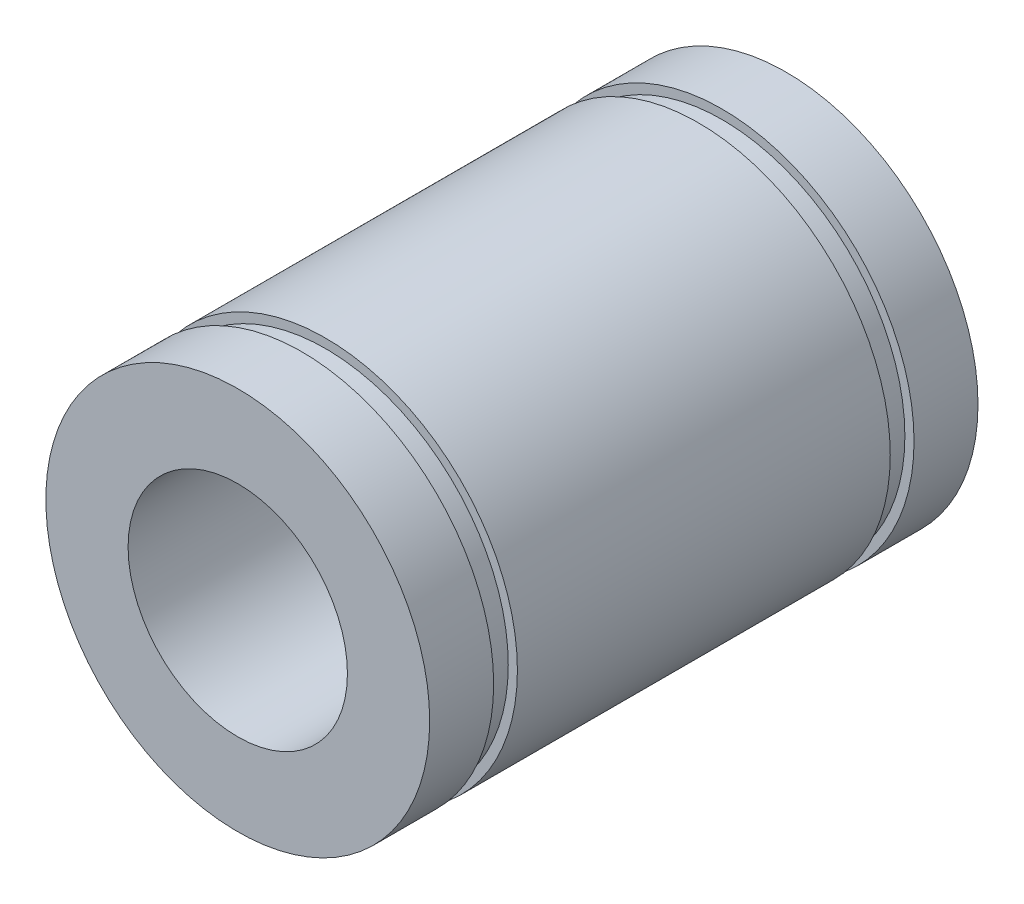
ISO-10303-21;
HEADER;
FILE_DESCRIPTION(('STEP AP214'),'2;1');
FILE_NAME('part.step','',(''),(''),'','','');
FILE_SCHEMA(('AUTOMOTIVE_DESIGN { 1 0 10303 214 1 1 1 1 }'));
ENDSEC;
DATA;
#1=APPLICATION_CONTEXT('core data for automotive mechanical design processes');
#2=APPLICATION_PROTOCOL_DEFINITION('international standard','automotive_design',2000,#1);
#3=PRODUCT_CONTEXT('',#1,'mechanical');
#4=PRODUCT('Part','Part','',(#3));
#5=PRODUCT_RELATED_PRODUCT_CATEGORY('part','',(#4));
#6=PRODUCT_DEFINITION_FORMATION('','',#4);
#7=PRODUCT_DEFINITION_CONTEXT('part definition',#1,'design');
#8=PRODUCT_DEFINITION('design','',#6,#7);
#9=PRODUCT_DEFINITION_SHAPE('','',#8);
#10=(LENGTH_UNIT() NAMED_UNIT(*) SI_UNIT(.MILLI.,.METRE.));
#11=(NAMED_UNIT(*) PLANE_ANGLE_UNIT() SI_UNIT($,.RADIAN.));
#12=(NAMED_UNIT(*) SI_UNIT($,.STERADIAN.) SOLID_ANGLE_UNIT());
#13=UNCERTAINTY_MEASURE_WITH_UNIT(LENGTH_MEASURE(1.E-05),#10,'distance_accuracy_value','');
#14=(GEOMETRIC_REPRESENTATION_CONTEXT(3) GLOBAL_UNCERTAINTY_ASSIGNED_CONTEXT((#13)) GLOBAL_UNIT_ASSIGNED_CONTEXT((#10,
#11,#12)) REPRESENTATION_CONTEXT('',''));
#15=CARTESIAN_POINT('',(0.,0.,0.));
#16=DIRECTION('',(0.,0.,1.));
#17=DIRECTION('',(1.,0.,0.));
#18=AXIS2_PLACEMENT_3D('',#15,#16,#17);
#19=CARTESIAN_POINT('',(0.,0.,0.));
#20=DIRECTION('',(0.,0.,1.));
#21=DIRECTION('',(1.,0.,0.));
#22=AXIS2_PLACEMENT_3D('',#19,#20,#21);
#23=CYLINDRICAL_SURFACE('',#22,10.5);
#24=CARTESIAN_POINT('',(0.,0.,0.));
#25=DIRECTION('',(0.,0.,1.));
#26=DIRECTION('',(1.,0.,0.));
#27=AXIS2_PLACEMENT_3D('',#24,#25,#26);
#28=CIRCLE('',#27,10.5);
#29=CARTESIAN_POINT('',(10.5,0.,0.));
#30=VERTEX_POINT('',#29);
#31=EDGE_CURVE('E10',#30,#30,#28,.T.);
#32=ORIENTED_EDGE('',*,*,#31,.T.);
#33=EDGE_LOOP('',(#32));
#34=FACE_BOUND('',#33,.T.);
#35=CARTESIAN_POINT('',(0.,0.,3.5));
#36=DIRECTION('',(0.,0.,1.));
#37=DIRECTION('',(1.,0.,0.));
#38=AXIS2_PLACEMENT_3D('',#35,#36,#37);
#39=CIRCLE('',#38,10.5);
#40=CARTESIAN_POINT('',(10.5,0.,3.5));
#41=VERTEX_POINT('',#40);
#42=EDGE_CURVE('E72',#41,#41,#39,.T.);
#43=ORIENTED_EDGE('',*,*,#42,.F.);
#44=EDGE_LOOP('',(#43));
#45=FACE_BOUND('',#44,.T.);
#46=ADVANCED_FACE('F32',(#34,#45),#23,.T.);
#47=CARTESIAN_POINT('',(10.5,0.,0.));
#48=DIRECTION('',(0.,0.,-1.));
#49=DIRECTION('',(-1.,0.,0.));
#50=AXIS2_PLACEMENT_3D('',#47,#48,#49);
#51=PLANE('',#50);
#52=CARTESIAN_POINT('',(0.,0.,0.));
#53=DIRECTION('',(0.,0.,1.));
#54=DIRECTION('',(1.,0.,0.));
#55=AXIS2_PLACEMENT_3D('',#52,#53,#54);
#56=CIRCLE('',#55,6.);
#57=CARTESIAN_POINT('',(6.,0.,0.));
#58=VERTEX_POINT('',#57);
#59=EDGE_CURVE('E38',#58,#58,#56,.T.);
#60=ORIENTED_EDGE('',*,*,#59,.T.);
#61=EDGE_LOOP('',(#60));
#62=FACE_BOUND('',#61,.T.);
#63=ORIENTED_EDGE('',*,*,#31,.F.);
#64=EDGE_LOOP('',(#63));
#65=FACE_BOUND('',#64,.T.);
#66=ADVANCED_FACE('F80',(#62,#65),#51,.T.);
#67=CARTESIAN_POINT('',(0.,0.,0.));
#68=DIRECTION('',(0.,0.,1.));
#69=DIRECTION('',(1.,0.,0.));
#70=AXIS2_PLACEMENT_3D('',#67,#68,#69);
#71=CYLINDRICAL_SURFACE('',#70,6.);
#72=CARTESIAN_POINT('',(0.,0.,30.));
#73=DIRECTION('',(0.,0.,1.));
#74=DIRECTION('',(1.,0.,0.));
#75=AXIS2_PLACEMENT_3D('',#72,#73,#74);
#76=CIRCLE('',#75,6.);
#77=CARTESIAN_POINT('',(6.,0.,30.));
#78=VERTEX_POINT('',#77);
#79=EDGE_CURVE('E42',#78,#78,#76,.T.);
#80=ORIENTED_EDGE('',*,*,#79,.T.);
#81=EDGE_LOOP('',(#80));
#82=FACE_BOUND('',#81,.T.);
#83=ORIENTED_EDGE('',*,*,#59,.F.);
#84=EDGE_LOOP('',(#83));
#85=FACE_BOUND('',#84,.T.);
#86=ADVANCED_FACE('F84',(#82,#85),#71,.F.);
#87=CARTESIAN_POINT('',(6.,0.,30.));
#88=DIRECTION('',(0.,0.,1.));
#89=DIRECTION('',(1.,0.,0.));
#90=AXIS2_PLACEMENT_3D('',#87,#88,#89);
#91=PLANE('',#90);
#92=CARTESIAN_POINT('',(0.,0.,30.));
#93=DIRECTION('',(0.,0.,1.));
#94=DIRECTION('',(1.,0.,0.));
#95=AXIS2_PLACEMENT_3D('',#92,#93,#94);
#96=CIRCLE('',#95,10.5);
#97=CARTESIAN_POINT('',(10.5,0.,30.));
#98=VERTEX_POINT('',#97);
#99=EDGE_CURVE('E46',#98,#98,#96,.T.);
#100=ORIENTED_EDGE('',*,*,#99,.T.);
#101=EDGE_LOOP('',(#100));
#102=FACE_BOUND('',#101,.T.);
#103=ORIENTED_EDGE('',*,*,#79,.F.);
#104=EDGE_LOOP('',(#103));
#105=FACE_BOUND('',#104,.T.);
#106=ADVANCED_FACE('F88',(#102,#105),#91,.T.);
#107=CARTESIAN_POINT('',(0.,0.,0.));
#108=DIRECTION('',(0.,0.,1.));
#109=DIRECTION('',(1.,0.,0.));
#110=AXIS2_PLACEMENT_3D('',#107,#108,#109);
#111=CYLINDRICAL_SURFACE('',#110,10.5);
#112=CARTESIAN_POINT('',(0.,0.,26.5));
#113=DIRECTION('',(0.,0.,1.));
#114=DIRECTION('',(1.,0.,0.));
#115=AXIS2_PLACEMENT_3D('',#112,#113,#114);
#116=CIRCLE('',#115,10.5);
#117=CARTESIAN_POINT('',(10.5,0.,26.5));
#118=VERTEX_POINT('',#117);
#119=EDGE_CURVE('E51',#118,#118,#116,.T.);
#120=ORIENTED_EDGE('',*,*,#119,.T.);
#121=EDGE_LOOP('',(#120));
#122=FACE_BOUND('',#121,.T.);
#123=ORIENTED_EDGE('',*,*,#99,.F.);
#124=EDGE_LOOP('',(#123));
#125=FACE_BOUND('',#124,.T.);
#126=ADVANCED_FACE('F95',(#122,#125),#111,.T.);
#127=CARTESIAN_POINT('',(10.5,0.,26.5));
#128=DIRECTION('',(0.,0.,-1.));
#129=DIRECTION('',(-1.,0.,0.));
#130=AXIS2_PLACEMENT_3D('',#127,#128,#129);
#131=PLANE('',#130);
#132=CARTESIAN_POINT('',(0.,0.,26.5));
#133=DIRECTION('',(0.,0.,1.));
#134=DIRECTION('',(1.,0.,0.));
#135=AXIS2_PLACEMENT_3D('',#132,#133,#134);
#136=CIRCLE('',#135,10.);
#137=CARTESIAN_POINT('',(10.,0.,26.5));
#138=VERTEX_POINT('',#137);
#139=EDGE_CURVE('E54',#138,#138,#136,.T.);
#140=ORIENTED_EDGE('',*,*,#139,.T.);
#141=EDGE_LOOP('',(#140));
#142=FACE_BOUND('',#141,.T.);
#143=ORIENTED_EDGE('',*,*,#119,.F.);
#144=EDGE_LOOP('',(#143));
#145=FACE_BOUND('',#144,.T.);
#146=ADVANCED_FACE('F99',(#142,#145),#131,.T.);
#147=CARTESIAN_POINT('',(0.,0.,0.));
#148=DIRECTION('',(0.,0.,1.));
#149=DIRECTION('',(1.,0.,0.));
#150=AXIS2_PLACEMENT_3D('',#147,#148,#149);
#151=CYLINDRICAL_SURFACE('',#150,10.);
#152=CARTESIAN_POINT('',(0.,0.,25.2));
#153=DIRECTION('',(0.,0.,1.));
#154=DIRECTION('',(1.,0.,0.));
#155=AXIS2_PLACEMENT_3D('',#152,#153,#154);
#156=CIRCLE('',#155,10.);
#157=CARTESIAN_POINT('',(10.,0.,25.2));
#158=VERTEX_POINT('',#157);
#159=EDGE_CURVE('E57',#158,#158,#156,.T.);
#160=ORIENTED_EDGE('',*,*,#159,.T.);
#161=EDGE_LOOP('',(#160));
#162=FACE_BOUND('',#161,.T.);
#163=ORIENTED_EDGE('',*,*,#139,.F.);
#164=EDGE_LOOP('',(#163));
#165=FACE_BOUND('',#164,.T.);
#166=ADVANCED_FACE('F103',(#162,#165),#151,.T.);
#167=CARTESIAN_POINT('',(10.,0.,25.2));
#168=DIRECTION('',(0.,0.,1.));
#169=DIRECTION('',(1.,0.,0.));
#170=AXIS2_PLACEMENT_3D('',#167,#168,#169);
#171=PLANE('',#170);
#172=CARTESIAN_POINT('',(0.,0.,25.2));
#173=DIRECTION('',(0.,0.,1.));
#174=DIRECTION('',(1.,0.,0.));
#175=AXIS2_PLACEMENT_3D('',#172,#173,#174);
#176=CIRCLE('',#175,10.5);
#177=CARTESIAN_POINT('',(10.5,0.,25.2));
#178=VERTEX_POINT('',#177);
#179=EDGE_CURVE('E60',#178,#178,#176,.T.);
#180=ORIENTED_EDGE('',*,*,#179,.T.);
#181=EDGE_LOOP('',(#180));
#182=FACE_BOUND('',#181,.T.);
#183=ORIENTED_EDGE('',*,*,#159,.F.);
#184=EDGE_LOOP('',(#183));
#185=FACE_BOUND('',#184,.T.);
#186=ADVANCED_FACE('F107',(#182,#185),#171,.T.);
#187=CARTESIAN_POINT('',(0.,0.,0.));
#188=DIRECTION('',(0.,0.,1.));
#189=DIRECTION('',(1.,0.,0.));
#190=AXIS2_PLACEMENT_3D('',#187,#188,#189);
#191=CYLINDRICAL_SURFACE('',#190,10.5);
#192=CARTESIAN_POINT('',(0.,0.,4.8));
#193=DIRECTION('',(0.,0.,1.));
#194=DIRECTION('',(1.,0.,0.));
#195=AXIS2_PLACEMENT_3D('',#192,#193,#194);
#196=CIRCLE('',#195,10.5);
#197=CARTESIAN_POINT('',(10.5,0.,4.8));
#198=VERTEX_POINT('',#197);
#199=EDGE_CURVE('E63',#198,#198,#196,.T.);
#200=ORIENTED_EDGE('',*,*,#199,.T.);
#201=EDGE_LOOP('',(#200));
#202=FACE_BOUND('',#201,.T.);
#203=ORIENTED_EDGE('',*,*,#179,.F.);
#204=EDGE_LOOP('',(#203));
#205=FACE_BOUND('',#204,.T.);
#206=ADVANCED_FACE('F111',(#202,#205),#191,.T.);
#207=CARTESIAN_POINT('',(10.5,0.,4.8));
#208=DIRECTION('',(0.,0.,-1.));
#209=DIRECTION('',(-1.,0.,0.));
#210=AXIS2_PLACEMENT_3D('',#207,#208,#209);
#211=PLANE('',#210);
#212=CARTESIAN_POINT('',(0.,0.,4.8));
#213=DIRECTION('',(0.,0.,1.));
#214=DIRECTION('',(1.,0.,0.));
#215=AXIS2_PLACEMENT_3D('',#212,#213,#214);
#216=CIRCLE('',#215,10.);
#217=CARTESIAN_POINT('',(10.,0.,4.8));
#218=VERTEX_POINT('',#217);
#219=EDGE_CURVE('E66',#218,#218,#216,.T.);
#220=ORIENTED_EDGE('',*,*,#219,.T.);
#221=EDGE_LOOP('',(#220));
#222=FACE_BOUND('',#221,.T.);
#223=ORIENTED_EDGE('',*,*,#199,.F.);
#224=EDGE_LOOP('',(#223));
#225=FACE_BOUND('',#224,.T.);
#226=ADVANCED_FACE('F115',(#222,#225),#211,.T.);
#227=CARTESIAN_POINT('',(0.,0.,0.));
#228=DIRECTION('',(0.,0.,1.));
#229=DIRECTION('',(1.,0.,0.));
#230=AXIS2_PLACEMENT_3D('',#227,#228,#229);
#231=CYLINDRICAL_SURFACE('',#230,10.);
#232=CARTESIAN_POINT('',(0.,0.,3.5));
#233=DIRECTION('',(0.,0.,1.));
#234=DIRECTION('',(1.,0.,0.));
#235=AXIS2_PLACEMENT_3D('',#232,#233,#234);
#236=CIRCLE('',#235,10.);
#237=CARTESIAN_POINT('',(10.,0.,3.5));
#238=VERTEX_POINT('',#237);
#239=EDGE_CURVE('E69',#238,#238,#236,.T.);
#240=ORIENTED_EDGE('',*,*,#239,.T.);
#241=EDGE_LOOP('',(#240));
#242=FACE_BOUND('',#241,.T.);
#243=ORIENTED_EDGE('',*,*,#219,.F.);
#244=EDGE_LOOP('',(#243));
#245=FACE_BOUND('',#244,.T.);
#246=ADVANCED_FACE('F119',(#242,#245),#231,.T.);
#247=CARTESIAN_POINT('',(10.,0.,3.5));
#248=DIRECTION('',(0.,0.,1.));
#249=DIRECTION('',(1.,0.,0.));
#250=AXIS2_PLACEMENT_3D('',#247,#248,#249);
#251=PLANE('',#250);
#252=ORIENTED_EDGE('',*,*,#42,.T.);
#253=EDGE_LOOP('',(#252));
#254=FACE_BOUND('',#253,.T.);
#255=ORIENTED_EDGE('',*,*,#239,.F.);
#256=EDGE_LOOP('',(#255));
#257=FACE_BOUND('',#256,.T.);
#258=ADVANCED_FACE('F76',(#254,#257),#251,.T.);
#259=CLOSED_SHELL('',(#46,#66,#86,#106,#126,#146,#166,#186,#206,#226,#246,#258));
#260=MANIFOLD_SOLID_BREP('B2',#259);
#261=ADVANCED_BREP_SHAPE_REPRESENTATION('',(#18,#260),#14);
#262=SHAPE_DEFINITION_REPRESENTATION(#9,#261);
ENDSEC;
END-ISO-10303-21;
